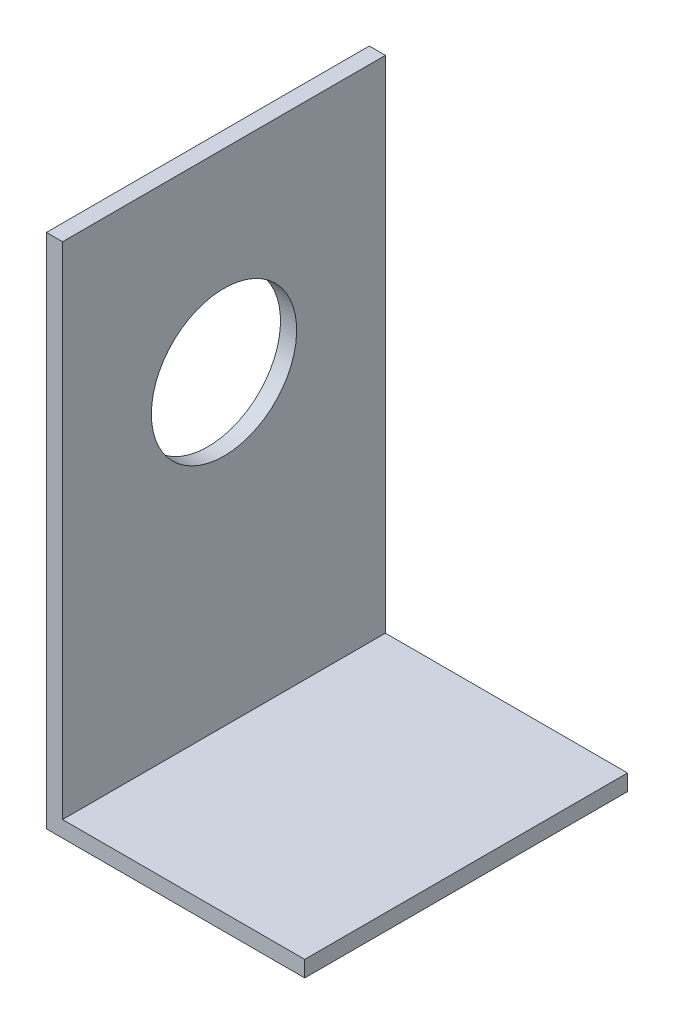
ISO-10303-21;
HEADER;
FILE_DESCRIPTION(('STEP AP214'),'2;1');
FILE_NAME('part.step','',(''),(''),'','','');
FILE_SCHEMA(('AUTOMOTIVE_DESIGN { 1 0 10303 214 1 1 1 1 }'));
ENDSEC;
DATA;
#1=APPLICATION_CONTEXT('core data for automotive mechanical design processes');
#2=APPLICATION_PROTOCOL_DEFINITION('international standard','automotive_design',2000,#1);
#3=PRODUCT_CONTEXT('',#1,'mechanical');
#4=PRODUCT('Part','Part','',(#3));
#5=PRODUCT_RELATED_PRODUCT_CATEGORY('part','',(#4));
#6=PRODUCT_DEFINITION_FORMATION('','',#4);
#7=PRODUCT_DEFINITION_CONTEXT('part definition',#1,'design');
#8=PRODUCT_DEFINITION('design','',#6,#7);
#9=PRODUCT_DEFINITION_SHAPE('','',#8);
#10=(LENGTH_UNIT() NAMED_UNIT(*) SI_UNIT(.MILLI.,.METRE.));
#11=(NAMED_UNIT(*) PLANE_ANGLE_UNIT() SI_UNIT($,.RADIAN.));
#12=(NAMED_UNIT(*) SI_UNIT($,.STERADIAN.) SOLID_ANGLE_UNIT());
#13=UNCERTAINTY_MEASURE_WITH_UNIT(LENGTH_MEASURE(1.E-05),#10,'distance_accuracy_value','');
#14=(GEOMETRIC_REPRESENTATION_CONTEXT(3) GLOBAL_UNCERTAINTY_ASSIGNED_CONTEXT((#13)) GLOBAL_UNIT_ASSIGNED_CONTEXT((#10,
#11,#12)) REPRESENTATION_CONTEXT('',''));
#15=CARTESIAN_POINT('',(0.,0.,0.));
#16=DIRECTION('',(0.,0.,1.));
#17=DIRECTION('',(1.,0.,0.));
#18=AXIS2_PLACEMENT_3D('',#15,#16,#17);
#19=CARTESIAN_POINT('',(50.8,0.,63.5));
#20=DIRECTION('',(0.,1.,0.));
#21=DIRECTION('',(-1.,0.,0.));
#22=AXIS2_PLACEMENT_3D('',#19,#20,#21);
#23=PLANE('',#22);
#24=DIRECTION('',(1.,0.,0.));
#25=VECTOR('',#24,1.);
#26=CARTESIAN_POINT('',(50.8,0.,0.));
#27=LINE('',#26,#25);
#28=CARTESIAN_POINT('',(0.,0.,0.));
#29=VERTEX_POINT('',#28);
#30=CARTESIAN_POINT('',(50.8,0.,0.));
#31=VERTEX_POINT('',#30);
#32=EDGE_CURVE('E119',#29,#31,#27,.T.);
#33=ORIENTED_EDGE('',*,*,#32,.T.);
#34=DIRECTION('',(0.,0.,-1.));
#35=VECTOR('',#34,1.);
#36=CARTESIAN_POINT('',(50.8,0.,63.5));
#37=LINE('',#36,#35);
#38=CARTESIAN_POINT('',(50.8,0.,63.5));
#39=VERTEX_POINT('',#38);
#40=EDGE_CURVE('E11',#39,#31,#37,.T.);
#41=ORIENTED_EDGE('',*,*,#40,.F.);
#42=DIRECTION('',(1.,0.,0.));
#43=VECTOR('',#42,1.);
#44=CARTESIAN_POINT('',(50.8,0.,63.5));
#45=LINE('',#44,#43);
#46=CARTESIAN_POINT('',(0.,0.,63.5));
#47=VERTEX_POINT('',#46);
#48=EDGE_CURVE('E130',#47,#39,#45,.T.);
#49=ORIENTED_EDGE('',*,*,#48,.F.);
#50=DIRECTION('',(0.,0.,-1.));
#51=VECTOR('',#50,1.);
#52=CARTESIAN_POINT('',(0.,0.,63.5));
#53=LINE('',#52,#51);
#54=EDGE_CURVE('E115',#47,#29,#53,.T.);
#55=ORIENTED_EDGE('',*,*,#54,.T.);
#56=EDGE_LOOP('',(#33,#41,#49,#55));
#57=FACE_BOUND('',#56,.T.);
#58=ADVANCED_FACE('F35',(#57),#23,.F.);
#59=CARTESIAN_POINT('',(50.8,3.175,63.5));
#60=DIRECTION('',(-1.,0.,0.));
#61=DIRECTION('',(0.,0.,1.));
#62=AXIS2_PLACEMENT_3D('',#59,#60,#61);
#63=PLANE('',#62);
#64=DIRECTION('',(0.,1.,0.));
#65=VECTOR('',#64,1.);
#66=CARTESIAN_POINT('',(50.8,3.175,0.));
#67=LINE('',#66,#65);
#68=CARTESIAN_POINT('',(50.8,3.175,0.));
#69=VERTEX_POINT('',#68);
#70=EDGE_CURVE('E122',#31,#69,#67,.T.);
#71=ORIENTED_EDGE('',*,*,#70,.T.);
#72=DIRECTION('',(0.,0.,-1.));
#73=VECTOR('',#72,1.);
#74=CARTESIAN_POINT('',(50.8,3.175,63.5));
#75=LINE('',#74,#73);
#76=CARTESIAN_POINT('',(50.8,3.175,63.5));
#77=VERTEX_POINT('',#76);
#78=EDGE_CURVE('E43',#77,#69,#75,.T.);
#79=ORIENTED_EDGE('',*,*,#78,.F.);
#80=DIRECTION('',(0.,1.,0.));
#81=VECTOR('',#80,1.);
#82=CARTESIAN_POINT('',(50.8,3.175,63.5));
#83=LINE('',#82,#81);
#84=EDGE_CURVE('E88',#39,#77,#83,.T.);
#85=ORIENTED_EDGE('',*,*,#84,.F.);
#86=ORIENTED_EDGE('',*,*,#40,.T.);
#87=EDGE_LOOP('',(#71,#79,#85,#86));
#88=FACE_BOUND('',#87,.T.);
#89=ADVANCED_FACE('F156',(#88),#63,.F.);
#90=CARTESIAN_POINT('',(3.17500000000001,3.175,63.5));
#91=DIRECTION('',(0.,-1.,0.));
#92=DIRECTION('',(0.,0.,-1.));
#93=AXIS2_PLACEMENT_3D('',#90,#91,#92);
#94=PLANE('',#93);
#95=DIRECTION('',(-1.,0.,0.));
#96=VECTOR('',#95,1.);
#97=CARTESIAN_POINT('',(3.17500000000001,3.175,0.));
#98=LINE('',#97,#96);
#99=CARTESIAN_POINT('',(3.17500000000001,3.175,0.));
#100=VERTEX_POINT('',#99);
#101=EDGE_CURVE('E125',#69,#100,#98,.T.);
#102=ORIENTED_EDGE('',*,*,#101,.T.);
#103=DIRECTION('',(0.,0.,-1.));
#104=VECTOR('',#103,1.);
#105=CARTESIAN_POINT('',(3.17500000000001,3.175,63.5));
#106=LINE('',#105,#104);
#107=CARTESIAN_POINT('',(3.17500000000001,3.175,63.5));
#108=VERTEX_POINT('',#107);
#109=EDGE_CURVE('E110',#108,#100,#106,.T.);
#110=ORIENTED_EDGE('',*,*,#109,.F.);
#111=DIRECTION('',(-1.,0.,0.));
#112=VECTOR('',#111,1.);
#113=CARTESIAN_POINT('',(3.17500000000001,3.175,63.5));
#114=LINE('',#113,#112);
#115=EDGE_CURVE('E101',#77,#108,#114,.T.);
#116=ORIENTED_EDGE('',*,*,#115,.F.);
#117=ORIENTED_EDGE('',*,*,#78,.T.);
#118=EDGE_LOOP('',(#102,#110,#116,#117));
#119=FACE_BOUND('',#118,.T.);
#120=ADVANCED_FACE('F136',(#119),#94,.F.);
#121=CARTESIAN_POINT('',(3.175,101.6,63.5));
#122=DIRECTION('',(-1.,0.,0.));
#123=DIRECTION('',(0.,-1.,0.));
#124=AXIS2_PLACEMENT_3D('',#121,#122,#123);
#125=PLANE('',#124);
#126=CARTESIAN_POINT('',(3.175,63.5,31.75));
#127=DIRECTION('',(-1.,0.,0.));
#128=DIRECTION('',(0.,-1.,0.));
#129=AXIS2_PLACEMENT_3D('',#126,#127,#128);
#130=CIRCLE('',#129,14.2875);
#131=CARTESIAN_POINT('',(3.175,49.2125,31.75));
#132=VERTEX_POINT('',#131);
#133=EDGE_CURVE('E123',#132,#132,#130,.T.);
#134=ORIENTED_EDGE('',*,*,#133,.T.);
#135=EDGE_LOOP('',(#134));
#136=FACE_BOUND('',#135,.T.);
#137=DIRECTION('',(0.,1.,0.));
#138=VECTOR('',#137,1.);
#139=CARTESIAN_POINT('',(3.175,101.6,0.));
#140=LINE('',#139,#138);
#141=CARTESIAN_POINT('',(3.175,101.6,0.));
#142=VERTEX_POINT('',#141);
#143=EDGE_CURVE('E109',#100,#142,#140,.T.);
#144=ORIENTED_EDGE('',*,*,#143,.T.);
#145=DIRECTION('',(0.,0.,-1.));
#146=VECTOR('',#145,1.);
#147=CARTESIAN_POINT('',(3.175,101.6,63.5));
#148=LINE('',#147,#146);
#149=CARTESIAN_POINT('',(3.175,101.6,63.5));
#150=VERTEX_POINT('',#149);
#151=EDGE_CURVE('E106',#150,#142,#148,.T.);
#152=ORIENTED_EDGE('',*,*,#151,.F.);
#153=DIRECTION('',(0.,1.,0.));
#154=VECTOR('',#153,1.);
#155=CARTESIAN_POINT('',(3.175,101.6,63.5));
#156=LINE('',#155,#154);
#157=EDGE_CURVE('E95',#108,#150,#156,.T.);
#158=ORIENTED_EDGE('',*,*,#157,.F.);
#159=ORIENTED_EDGE('',*,*,#109,.T.);
#160=EDGE_LOOP('',(#144,#152,#158,#159));
#161=FACE_BOUND('',#160,.T.);
#162=ADVANCED_FACE('F107',(#136,#161),#125,.F.);
#163=CARTESIAN_POINT('',(0.,101.6,63.5));
#164=DIRECTION('',(0.,-1.,0.));
#165=DIRECTION('',(0.,0.,-1.));
#166=AXIS2_PLACEMENT_3D('',#163,#164,#165);
#167=PLANE('',#166);
#168=DIRECTION('',(-1.,0.,0.));
#169=VECTOR('',#168,1.);
#170=CARTESIAN_POINT('',(0.,101.6,0.));
#171=LINE('',#170,#169);
#172=CARTESIAN_POINT('',(0.,101.6,0.));
#173=VERTEX_POINT('',#172);
#174=EDGE_CURVE('E74',#142,#173,#171,.T.);
#175=ORIENTED_EDGE('',*,*,#174,.T.);
#176=DIRECTION('',(0.,0.,-1.));
#177=VECTOR('',#176,1.);
#178=CARTESIAN_POINT('',(0.,101.6,63.5));
#179=LINE('',#178,#177);
#180=CARTESIAN_POINT('',(0.,101.6,63.5));
#181=VERTEX_POINT('',#180);
#182=EDGE_CURVE('E111',#181,#173,#179,.T.);
#183=ORIENTED_EDGE('',*,*,#182,.F.);
#184=DIRECTION('',(-1.,0.,0.));
#185=VECTOR('',#184,1.);
#186=CARTESIAN_POINT('',(0.,101.6,63.5));
#187=LINE('',#186,#185);
#188=EDGE_CURVE('E99',#150,#181,#187,.T.);
#189=ORIENTED_EDGE('',*,*,#188,.F.);
#190=ORIENTED_EDGE('',*,*,#151,.T.);
#191=EDGE_LOOP('',(#175,#183,#189,#190));
#192=FACE_BOUND('',#191,.T.);
#193=ADVANCED_FACE('F113',(#192),#167,.F.);
#194=CARTESIAN_POINT('',(0.,0.,63.5));
#195=DIRECTION('',(1.,0.,0.));
#196=DIRECTION('',(0.,0.,-1.));
#197=AXIS2_PLACEMENT_3D('',#194,#195,#196);
#198=PLANE('',#197);
#199=CARTESIAN_POINT('',(0.,63.5,31.75));
#200=DIRECTION('',(-1.,0.,0.));
#201=DIRECTION('',(0.,0.,1.));
#202=AXIS2_PLACEMENT_3D('',#199,#200,#201);
#203=CIRCLE('',#202,14.2875);
#204=CARTESIAN_POINT('',(0.,63.5,46.0375));
#205=VERTEX_POINT('',#204);
#206=EDGE_CURVE('E172',#205,#205,#203,.T.);
#207=ORIENTED_EDGE('',*,*,#206,.F.);
#208=EDGE_LOOP('',(#207));
#209=FACE_BOUND('',#208,.T.);
#210=DIRECTION('',(0.,-1.,0.));
#211=VECTOR('',#210,1.);
#212=CARTESIAN_POINT('',(0.,0.,0.));
#213=LINE('',#212,#211);
#214=EDGE_CURVE('E80',#173,#29,#213,.T.);
#215=ORIENTED_EDGE('',*,*,#214,.T.);
#216=ORIENTED_EDGE('',*,*,#54,.F.);
#217=DIRECTION('',(0.,-1.,0.));
#218=VECTOR('',#217,1.);
#219=CARTESIAN_POINT('',(0.,0.,63.5));
#220=LINE('',#219,#218);
#221=EDGE_CURVE('E51',#181,#47,#220,.T.);
#222=ORIENTED_EDGE('',*,*,#221,.F.);
#223=ORIENTED_EDGE('',*,*,#182,.T.);
#224=EDGE_LOOP('',(#215,#216,#222,#223));
#225=FACE_BOUND('',#224,.T.);
#226=ADVANCED_FACE('F143',(#209,#225),#198,.F.);
#227=CARTESIAN_POINT('',(0.,0.,63.5));
#228=DIRECTION('',(0.,0.,-1.));
#229=DIRECTION('',(-1.,0.,0.));
#230=AXIS2_PLACEMENT_3D('',#227,#228,#229);
#231=PLANE('',#230);
#232=ORIENTED_EDGE('',*,*,#48,.T.);
#233=ORIENTED_EDGE('',*,*,#84,.T.);
#234=ORIENTED_EDGE('',*,*,#115,.T.);
#235=ORIENTED_EDGE('',*,*,#157,.T.);
#236=ORIENTED_EDGE('',*,*,#188,.T.);
#237=ORIENTED_EDGE('',*,*,#221,.T.);
#238=EDGE_LOOP('',(#232,#233,#234,#235,#236,#237));
#239=FACE_BOUND('',#238,.T.);
#240=ADVANCED_FACE('F97',(#239),#231,.F.);
#241=CARTESIAN_POINT('',(0.,0.,0.));
#242=DIRECTION('',(0.,0.,-1.));
#243=DIRECTION('',(-1.,0.,0.));
#244=AXIS2_PLACEMENT_3D('',#241,#242,#243);
#245=PLANE('',#244);
#246=ORIENTED_EDGE('',*,*,#32,.F.);
#247=ORIENTED_EDGE('',*,*,#214,.F.);
#248=ORIENTED_EDGE('',*,*,#174,.F.);
#249=ORIENTED_EDGE('',*,*,#143,.F.);
#250=ORIENTED_EDGE('',*,*,#101,.F.);
#251=ORIENTED_EDGE('',*,*,#70,.F.);
#252=EDGE_LOOP('',(#246,#247,#248,#249,#250,#251));
#253=FACE_BOUND('',#252,.T.);
#254=ADVANCED_FACE('F139',(#253),#245,.T.);
#255=CARTESIAN_POINT('',(50.8,63.5,31.75));
#256=DIRECTION('',(-1.,0.,0.));
#257=DIRECTION('',(0.,0.,1.));
#258=AXIS2_PLACEMENT_3D('',#255,#256,#257);
#259=CYLINDRICAL_SURFACE('',#258,14.2875);
#260=ORIENTED_EDGE('',*,*,#206,.T.);
#261=EDGE_LOOP('',(#260));
#262=FACE_BOUND('',#261,.T.);
#263=ORIENTED_EDGE('',*,*,#133,.F.);
#264=EDGE_LOOP('',(#263));
#265=FACE_BOUND('',#264,.T.);
#266=ADVANCED_FACE('F179',(#262,#265),#259,.F.);
#267=CLOSED_SHELL('',(#58,#89,#120,#162,#193,#226,#240,#254,#266));
#268=MANIFOLD_SOLID_BREP('B2',#267);
#269=ADVANCED_BREP_SHAPE_REPRESENTATION('',(#18,#268),#14);
#270=SHAPE_DEFINITION_REPRESENTATION(#9,#269);
ENDSEC;
END-ISO-10303-21;
